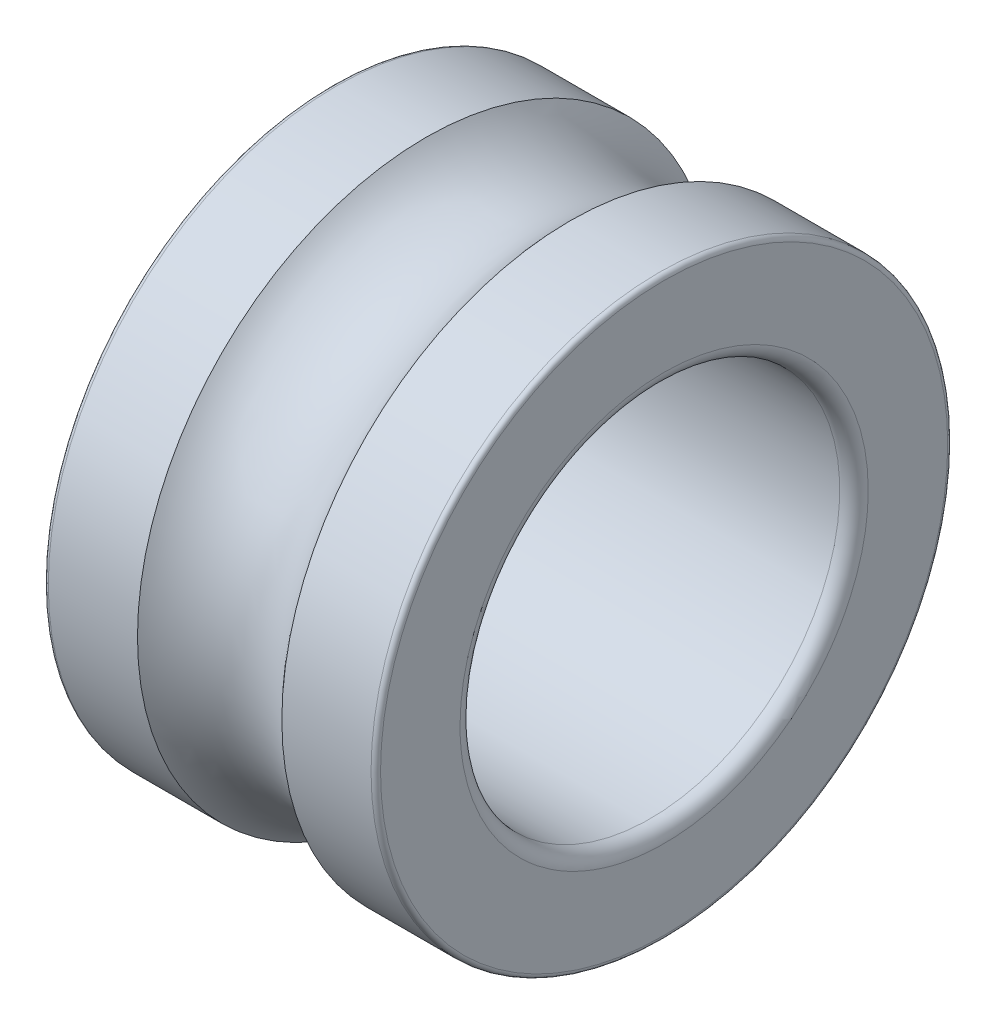
ISO-10303-21;
HEADER;
FILE_DESCRIPTION(('STEP AP214'),'2;1');
FILE_NAME('part.step','',(''),(''),'','','');
FILE_SCHEMA(('AUTOMOTIVE_DESIGN { 1 0 10303 214 1 1 1 1 }'));
ENDSEC;
DATA;
#1=APPLICATION_CONTEXT('core data for automotive mechanical design processes');
#2=APPLICATION_PROTOCOL_DEFINITION('international standard','automotive_design',2000,#1);
#3=PRODUCT_CONTEXT('',#1,'mechanical');
#4=PRODUCT('Part','Part','',(#3));
#5=PRODUCT_RELATED_PRODUCT_CATEGORY('part','',(#4));
#6=PRODUCT_DEFINITION_FORMATION('','',#4);
#7=PRODUCT_DEFINITION_CONTEXT('part definition',#1,'design');
#8=PRODUCT_DEFINITION('design','',#6,#7);
#9=PRODUCT_DEFINITION_SHAPE('','',#8);
#10=(LENGTH_UNIT() NAMED_UNIT(*) SI_UNIT(.MILLI.,.METRE.));
#11=(NAMED_UNIT(*) PLANE_ANGLE_UNIT() SI_UNIT($,.RADIAN.));
#12=(NAMED_UNIT(*) SI_UNIT($,.STERADIAN.) SOLID_ANGLE_UNIT());
#13=UNCERTAINTY_MEASURE_WITH_UNIT(LENGTH_MEASURE(1.E-05),#10,'distance_accuracy_value','');
#14=(GEOMETRIC_REPRESENTATION_CONTEXT(3) GLOBAL_UNCERTAINTY_ASSIGNED_CONTEXT((#13)) GLOBAL_UNIT_ASSIGNED_CONTEXT((#10,
#11,#12)) REPRESENTATION_CONTEXT('',''));
#15=CARTESIAN_POINT('',(0.,0.,0.));
#16=DIRECTION('',(0.,0.,1.));
#17=DIRECTION('',(1.,0.,0.));
#18=AXIS2_PLACEMENT_3D('',#15,#16,#17);
#19=CARTESIAN_POINT('',(3.5,0.,0.));
#20=DIRECTION('',(1.,0.,0.));
#21=DIRECTION('',(0.,1.,0.));
#22=AXIS2_PLACEMENT_3D('',#19,#20,#21);
#23=TOROIDAL_SURFACE('',#22,7.35,1.9845);
#24=CARTESIAN_POINT('',(1.979271473931,0.,0.));
#25=DIRECTION('',(-1.,0.,0.));
#26=DIRECTION('',(0.,0.,1.));
#27=AXIS2_PLACEMENT_3D('',#24,#25,#26);
#28=CIRCLE('',#27,6.075);
#29=CARTESIAN_POINT('',(1.979271473931,0.,6.075));
#30=VERTEX_POINT('',#29);
#31=EDGE_CURVE('E288',#30,#30,#28,.T.);
#32=ORIENTED_EDGE('',*,*,#31,.F.);
#33=EDGE_LOOP('',(#32));
#34=FACE_BOUND('',#33,.T.);
#35=CARTESIAN_POINT('',(5.02072852606901,0.,0.));
#36=DIRECTION('',(-1.,0.,0.));
#37=DIRECTION('',(0.,0.,1.));
#38=AXIS2_PLACEMENT_3D('',#35,#36,#37);
#39=CIRCLE('',#38,6.075);
#40=CARTESIAN_POINT('',(5.02072852606901,0.,6.075));
#41=VERTEX_POINT('',#40);
#42=EDGE_CURVE('E285',#41,#41,#39,.F.);
#43=ORIENTED_EDGE('',*,*,#42,.F.);
#44=EDGE_LOOP('',(#43));
#45=FACE_BOUND('',#44,.T.);
#46=ADVANCED_FACE('F16',(#34,#45),#23,.F.);
#47=CARTESIAN_POINT('',(100.,0.,0.));
#48=DIRECTION('',(-1.,0.,0.));
#49=DIRECTION('',(0.,0.,1.));
#50=AXIS2_PLACEMENT_3D('',#47,#48,#49);
#51=CYLINDRICAL_SURFACE('',#50,6.075);
#52=ORIENTED_EDGE('',*,*,#31,.T.);
#53=EDGE_LOOP('',(#52));
#54=FACE_BOUND('',#53,.T.);
#55=CARTESIAN_POINT('',(0.0999999999999228,0.,0.));
#56=DIRECTION('',(1.,0.,0.));
#57=DIRECTION('',(0.,1.,0.));
#58=AXIS2_PLACEMENT_3D('',#55,#56,#57);
#59=CIRCLE('',#58,6.075);
#60=CARTESIAN_POINT('',(0.0999999999999228,6.075,0.));
#61=VERTEX_POINT('',#60);
#62=EDGE_CURVE('E283',#61,#61,#59,.F.);
#63=ORIENTED_EDGE('',*,*,#62,.F.);
#64=EDGE_LOOP('',(#63));
#65=FACE_BOUND('',#64,.T.);
#66=ADVANCED_FACE('F93',(#54,#65),#51,.T.);
#67=CARTESIAN_POINT('',(100.,0.,0.));
#68=DIRECTION('',(-1.,0.,0.));
#69=DIRECTION('',(0.,0.,1.));
#70=AXIS2_PLACEMENT_3D('',#67,#68,#69);
#71=CYLINDRICAL_SURFACE('',#70,6.075);
#72=CARTESIAN_POINT('',(6.90000000000015,0.,0.));
#73=DIRECTION('',(1.,0.,0.));
#74=DIRECTION('',(0.,1.,0.));
#75=AXIS2_PLACEMENT_3D('',#72,#73,#74);
#76=CIRCLE('',#75,6.075);
#77=CARTESIAN_POINT('',(6.90000000000015,6.075,0.));
#78=VERTEX_POINT('',#77);
#79=EDGE_CURVE('E63',#78,#78,#76,.T.);
#80=ORIENTED_EDGE('',*,*,#79,.F.);
#81=EDGE_LOOP('',(#80));
#82=FACE_BOUND('',#81,.T.);
#83=ORIENTED_EDGE('',*,*,#42,.T.);
#84=EDGE_LOOP('',(#83));
#85=FACE_BOUND('',#84,.T.);
#86=ADVANCED_FACE('F86',(#82,#85),#71,.T.);
#87=CARTESIAN_POINT('',(0.0999999999999228,0.,0.));
#88=DIRECTION('',(1.,0.,0.));
#89=DIRECTION('',(0.,1.,0.));
#90=AXIS2_PLACEMENT_3D('',#87,#88,#89);
#91=TOROIDAL_SURFACE('',#90,5.975,0.1);
#92=ORIENTED_EDGE('',*,*,#62,.T.);
#93=EDGE_LOOP('',(#92));
#94=FACE_BOUND('',#93,.T.);
#95=CARTESIAN_POINT('',(0.,0.,0.));
#96=DIRECTION('',(1.,0.,0.));
#97=DIRECTION('',(0.,0.,1.));
#98=AXIS2_PLACEMENT_3D('',#95,#96,#97);
#99=CIRCLE('',#98,5.975);
#100=CARTESIAN_POINT('',(0.,0.,-5.975));
#101=VERTEX_POINT('',#100);
#102=CARTESIAN_POINT('',(0.,0.,5.975));
#103=VERTEX_POINT('',#102);
#104=EDGE_CURVE('E55',#101,#103,#99,.F.);
#105=ORIENTED_EDGE('',*,*,#104,.F.);
#106=CARTESIAN_POINT('',(0.,0.,0.));
#107=DIRECTION('',(1.,0.,0.));
#108=DIRECTION('',(0.,0.,-1.));
#109=AXIS2_PLACEMENT_3D('',#106,#107,#108);
#110=CIRCLE('',#109,5.975);
#111=EDGE_CURVE('E58',#103,#101,#110,.F.);
#112=ORIENTED_EDGE('',*,*,#111,.F.);
#113=EDGE_LOOP('',(#105,#112));
#114=FACE_BOUND('',#113,.T.);
#115=ADVANCED_FACE('F67',(#94,#114),#91,.T.);
#116=CARTESIAN_POINT('',(6.90000000000015,0.,0.));
#117=DIRECTION('',(1.,0.,0.));
#118=DIRECTION('',(0.,1.,0.));
#119=AXIS2_PLACEMENT_3D('',#116,#117,#118);
#120=TOROIDAL_SURFACE('',#119,5.975,0.1);
#121=CARTESIAN_POINT('',(7.00000000000015,0.,0.));
#122=DIRECTION('',(-1.,0.,0.));
#123=DIRECTION('',(0.,0.,1.));
#124=AXIS2_PLACEMENT_3D('',#121,#122,#123);
#125=CIRCLE('',#124,5.975);
#126=CARTESIAN_POINT('',(7.00000000000009,0.,-5.975));
#127=VERTEX_POINT('',#126);
#128=CARTESIAN_POINT('',(7.00000000000009,0.,5.975));
#129=VERTEX_POINT('',#128);
#130=EDGE_CURVE('E132',#127,#129,#125,.F.);
#131=ORIENTED_EDGE('',*,*,#130,.F.);
#132=CARTESIAN_POINT('',(7.00000000000015,0.,0.));
#133=DIRECTION('',(-1.,0.,0.));
#134=DIRECTION('',(0.,0.,-1.));
#135=AXIS2_PLACEMENT_3D('',#132,#133,#134);
#136=CIRCLE('',#135,5.975);
#137=EDGE_CURVE('E203',#129,#127,#136,.F.);
#138=ORIENTED_EDGE('',*,*,#137,.F.);
#139=EDGE_LOOP('',(#131,#138));
#140=FACE_BOUND('',#139,.T.);
#141=ORIENTED_EDGE('',*,*,#79,.T.);
#142=EDGE_LOOP('',(#141));
#143=FACE_BOUND('',#142,.T.);
#144=ADVANCED_FACE('F85',(#140,#143),#120,.T.);
#145=CARTESIAN_POINT('',(0.,5.975,0.));
#146=DIRECTION('',(-1.,0.,0.));
#147=DIRECTION('',(0.,0.,1.));
#148=AXIS2_PLACEMENT_3D('',#145,#146,#147);
#149=PLANE('',#148);
#150=ORIENTED_EDGE('',*,*,#111,.T.);
#151=ORIENTED_EDGE('',*,*,#104,.T.);
#152=EDGE_LOOP('',(#150,#151));
#153=FACE_BOUND('',#152,.T.);
#154=CARTESIAN_POINT('',(0.,0.,0.));
#155=DIRECTION('',(-1.,0.,0.));
#156=DIRECTION('',(0.,0.,1.));
#157=AXIS2_PLACEMENT_3D('',#154,#155,#156);
#158=CIRCLE('',#157,4.3);
#159=CARTESIAN_POINT('',(0.,0.,4.3));
#160=VERTEX_POINT('',#159);
#161=CARTESIAN_POINT('',(0.,0.,-4.3));
#162=VERTEX_POINT('',#161);
#163=EDGE_CURVE('E184',#160,#162,#158,.T.);
#164=ORIENTED_EDGE('',*,*,#163,.F.);
#165=CARTESIAN_POINT('',(0.,0.,-4.3));
#166=CARTESIAN_POINT('',(2.49671021800981E-09,-0.054046572801846,-4.30000073348312));
#167=CARTESIAN_POINT('',(3.48087412716175E-10,-0.108093051584243,-4.29899065394799));
#168=CARTESIAN_POINT('',(2.35188656253454E-09,-0.216107919266334,-4.29495330591717));
#169=CARTESIAN_POINT('',(6.5039938251434E-09,-0.270076311931317,-4.29192613817001));
#170=CARTESIAN_POINT('',(3.66976681778465E-08,-0.377860547298024,-4.28385919757216));
#171=CARTESIAN_POINT('',(6.27384343719903E-08,-0.431676395508992,-4.27881949836261));
#172=CARTESIAN_POINT('',(1.55972177695549E-07,-0.539080623330251,-4.26673154636945));
#173=CARTESIAN_POINT('',(2.2316419872104E-07,-0.592669008196273,-4.25968334025331));
#174=CARTESIAN_POINT('',(4.68071726509785E-07,-0.699546576635404,-4.24360101196496));
#175=CARTESIAN_POINT('',(6.45786141346539E-07,-0.752835763159248,-4.23456690941336));
#176=CARTESIAN_POINT('',(1.0418507888524E-06,-0.859045181134571,-4.21447557208069));
#177=CARTESIAN_POINT('',(1.26021056679227E-06,-0.911965322883642,-4.20341786208028));
#178=CARTESIAN_POINT('',(1.50514438922708E-06,-1.01732666182027,-4.1792528448078));
#179=CARTESIAN_POINT('',(1.53174993585892E-06,-1.06976793626417,-4.16614587455774));
#180=CARTESIAN_POINT('',(1.40938071885895E-06,-1.174092597275,-4.13791375438998));
#181=CARTESIAN_POINT('',(1.26044158298803E-06,-1.2259760948895,-4.12278901454216));
#182=CARTESIAN_POINT('',(8.57081734526432E-07,-1.32910856495396,-4.0905515192748));
#183=CARTESIAN_POINT('',(6.02686509931085E-07,-1.3803576876476,-4.07343924494725));
#184=CARTESIAN_POINT('',(1.77942178420886E-07,-1.48212973884337,-4.03722126557191));
#185=CARTESIAN_POINT('',(7.56954286386194E-09,-1.53265286679224,-4.01811612040051));
#186=CARTESIAN_POINT('',(-8.12431259894773E-09,-1.63663659883124,-3.97659587196171));
#187=CARTESIAN_POINT('',(1.7128668735591E-07,-1.69004118523969,-3.95404081235803));
#188=CARTESIAN_POINT('',(2.55090752332243E-07,-1.79597075624944,-3.90696536554014));
#189=CARTESIAN_POINT('',(1.59512400082297E-07,-1.8484958316974,-3.88244518284076));
#190=CARTESIAN_POINT('',(2.86630517072247E-08,-1.92657155764992,-3.84421592356576));
#191=CARTESIAN_POINT('',(-1.28678287933598E-08,-1.95247872722599,-3.83123103084005));
#192=CARTESIAN_POINT('',(2.352576789322E-08,-2.00399903154537,-3.80475148270328));
#193=CARTESIAN_POINT('',(1.01331966883277E-07,-2.02961243210967,-3.79125734494439));
#194=CARTESIAN_POINT('',(2.98647051560147E-07,-2.10599964303221,-3.74993940199472));
#195=CARTESIAN_POINT('',(3.82069424549149E-07,-2.15632435252802,-3.72127817810045));
#196=CARTESIAN_POINT('',(2.33392757075995E-07,-2.25564740842533,-3.66176235375574));
#197=CARTESIAN_POINT('',(1.3308325332146E-09,-2.30464591016013,-3.63090801172472));
#198=CARTESIAN_POINT('',(-1.36099111505517E-09,-2.40244930430766,-3.56653508193157));
#199=CARTESIAN_POINT('',(2.38541256310237E-07,-2.45122486987698,-3.53297208107998));
#200=CARTESIAN_POINT('',(3.50599624246333E-07,-2.54748637706888,-3.46405761800168));
#201=CARTESIAN_POINT('',(2.22802008220747E-07,-2.59497248017091,-3.428706381318));
#202=CARTESIAN_POINT('',(4.18529649493103E-08,-2.66517779619901,-3.37436010272899));
#203=CARTESIAN_POINT('',(-1.667331798547E-08,-2.68840942654281,-3.3560243561483));
#204=CARTESIAN_POINT('',(2.91664905174731E-08,-2.73446637693149,-3.31889317494392));
#205=CARTESIAN_POINT('',(1.33378497440828E-07,-2.75729206064616,-3.30009819171769));
#206=CARTESIAN_POINT('',(3.99145135959908E-07,-2.82512398737563,-3.24294925672565));
#207=CARTESIAN_POINT('',(5.13855692709291E-07,-2.86948903734758,-3.20382829948093));
#208=CARTESIAN_POINT('',(3.14151364569625E-07,-2.95637527857442,-3.12360806585847));
#209=CARTESIAN_POINT('',(-2.03498538097424E-10,-2.9988967268715,-3.082509066964));
#210=CARTESIAN_POINT('',(2.0363210482138E-10,-3.08227392383334,-2.99855655763944));
#211=CARTESIAN_POINT('',(3.15756360353574E-07,-3.12312751310941,-2.95570090820023));
#212=CARTESIAN_POINT('',(4.50812963996856E-07,-3.20318785652725,-2.86849330687443));
#213=CARTESIAN_POINT('',(2.703878612201E-07,-3.24239484563862,-2.82414157011923));
#214=CARTESIAN_POINT('',(7.09883368859781E-08,-3.30006384445633,-2.75663774432021));
#215=CARTESIAN_POINT('',(1.63944408036279E-08,-3.31909699519873,-2.73397326573285));
#216=CARTESIAN_POINT('',(1.84332790458536E-09,-3.34576929548992,-2.70123608887233));
#217=CARTESIAN_POINT('',(5.58135437689337E-09,-3.35368719545989,-2.69139083243446));
#218=CARTESIAN_POINT('',(2.11803381895731E-08,-3.39970488624447,-2.63366164906903));
#219=CARTESIAN_POINT('',(9.04540300892356E-09,-3.43684700243687,-2.58500851071631));
#220=CARTESIAN_POINT('',(-3.59069977410017E-09,-3.51654516085536,-2.47582279396198));
#221=CARTESIAN_POINT('',(-1.13185262829995E-09,-3.55861122179693,-2.41493186684719));
#222=CARTESIAN_POINT('',(8.86140752770533E-10,-3.63076861594309,-2.30451032039478));
#223=CARTESIAN_POINT('',(9.58723048321806E-10,-3.66147766562775,-2.25538168888329));
#224=CARTESIAN_POINT('',(1.92582828078602E-09,-3.72089036585843,-2.15592540561345));
#225=CARTESIAN_POINT('',(2.82034699147558E-09,-3.74959402671491,-2.10559776002147));
#226=CARTESIAN_POINT('',(3.67005066836595E-09,-3.80494863134142,-2.00382644304023));
#227=CARTESIAN_POINT('',(3.62523724451529E-09,-3.83159957862956,-1.9523827735639));
#228=CARTESIAN_POINT('',(2.86516049213339E-09,-3.88280610801995,-1.84846278432108));
#229=CARTESIAN_POINT('',(2.14989601449691E-09,-3.90736168653079,-1.79598646278485));
#230=CARTESIAN_POINT('',(7.34654162502496E-10,-3.95433600806416,-1.69008545171056));
#231=CARTESIAN_POINT('',(3.46768667664994E-11,-3.97675474009888,-1.63666075729758));
#232=CARTESIAN_POINT('',(-3.24769553495569E-11,-4.0179986169609,-1.53255332267863));
#233=CARTESIAN_POINT('',(5.14389107237958E-10,-4.03696379965678,-1.48192599041615));
#234=CARTESIAN_POINT('',(9.54549908405753E-09,-4.07298563372572,-1.37999818932739));
#235=CARTESIAN_POINT('',(1.80295319219935E-08,-4.09004233583827,-1.32869773843739));
#236=CARTESIAN_POINT('',(5.80920562090601E-08,-4.12222274875682,-1.22549503332114));
#237=CARTESIAN_POINT('',(8.96701564554287E-08,-4.13734649230115,-1.17359278930364));
#238=CARTESIAN_POINT('',(1.8785405654975E-07,-4.16563760809087,-1.06925835461273));
#239=CARTESIAN_POINT('',(2.54459601172312E-07,-4.17880499459024,-1.01682616780344));
#240=CARTESIAN_POINT('',(4.73169668582413E-07,-4.20317591649102,-0.911507058654501));
#241=CARTESIAN_POINT('',(6.25274393614012E-07,-4.21437944724696,-0.858620135239488));
#242=CARTESIAN_POINT('',(9.48511712861195E-07,-4.23476446331087,-0.75246832558631));
#243=CARTESIAN_POINT('',(1.11964051005336E-06,-4.24394635103298,-0.699203516750229));
#244=CARTESIAN_POINT('',(1.30028680363113E-06,-4.26023867461276,-0.592365381904515));
#245=CARTESIAN_POINT('',(1.30982728190566E-06,-4.26734940489928,-0.538792100851542));
#246=CARTESIAN_POINT('',(1.18883413384728E-06,-4.27949055884739,-0.431420714503159));
#247=CARTESIAN_POINT('',(1.05832523407056E-06,-4.28452134951757,-0.377622650564722));
#248=CARTESIAN_POINT('',(7.10101902679302E-07,-4.29252904904527,-0.269883785773033));
#249=CARTESIAN_POINT('',(4.92405862159521E-07,-4.29550639069323,-0.21594301740382));
#250=CARTESIAN_POINT('',(1.52291325852447E-07,-4.29927054959419,-0.107999581529397));
#251=CARTESIAN_POINT('',(2.98494877460852E-08,-4.30005790363189,-0.0539969324387693));
#252=CARTESIAN_POINT('',(-1.51167983332897E-08,-4.29997067580477,0.0273457214557082));
#253=CARTESIAN_POINT('',(-6.4861712400385E-09,-4.29972456636682,0.0546899767481284));
#254=CARTESIAN_POINT('',(1.51501621976376E-08,-4.29806056113197,0.145306606330561));
#255=CARTESIAN_POINT('',(1.89972501234406E-08,-4.29552770143827,0.208564531285454));
#256=CARTESIAN_POINT('',(9.95550454320622E-08,-4.28880794521745,0.316773012944989));
#257=CARTESIAN_POINT('',(1.55039334445988E-07,-4.28530429028855,0.361767848895122));
#258=CARTESIAN_POINT('',(2.71965709995477E-07,-4.27820157355766,0.437536161977546));
#259=CARTESIAN_POINT('',(3.26084758121884E-07,-4.27497688974408,0.468345103747978));
#260=CARTESIAN_POINT('',(4.81445279822012E-07,-4.26499820619289,0.554584167660605));
#261=CARTESIAN_POINT('',(5.85645569556012E-07,-4.25748880957285,0.609929183821199));
#262=CARTESIAN_POINT('',(7.2578453003893E-07,-4.24154406061026,0.712222530246199));
#263=CARTESIAN_POINT('',(7.69466653438446E-07,-4.23340383539211,0.759217372603164));
#264=CARTESIAN_POINT('',(8.00023756271925E-07,-4.21435245768529,0.859133696076649));
#265=CARTESIAN_POINT('',(7.78575561671954E-07,-4.20321680745278,0.912012595966069));
#266=CARTESIAN_POINT('',(7.01692481194374E-07,-4.17894640193969,1.01730480495944));
#267=CARTESIAN_POINT('',(6.46260124843912E-07,-4.16581179550118,1.0697181484214));
#268=CARTESIAN_POINT('',(5.0673363222123E-07,-4.13755807392831,1.17400239895525));
#269=CARTESIAN_POINT('',(4.22642018271043E-07,-4.12243913350861,1.22587335334927));
#270=CARTESIAN_POINT('',(2.55298167537419E-07,-4.09024287583351,1.3289982090508));
#271=CARTESIAN_POINT('',(1.72045846379708E-07,-4.07316575761366,1.38025217248716));
#272=CARTESIAN_POINT('',(4.45975579850565E-08,-4.03706931961047,1.48206456422819));
#273=CARTESIAN_POINT('',(3.97095687904752E-10,-4.0180502236395,1.53262307192355));
#274=CARTESIAN_POINT('',(-4.26015843379237E-10,-3.97668180982946,1.63663032965521));
#275=CARTESIAN_POINT('',(4.95340782899777E-08,-3.95419101379811,1.69002282575281));
#276=CARTESIAN_POINT('',(1.48954193274882E-07,-3.90711521368744,1.79587308448857));
#277=CARTESIAN_POINT('',(1.98414235687197E-07,-3.88253030033483,1.84833088750296));
#278=CARTESIAN_POINT('',(2.4818898123487E-07,-3.83129818856904,1.95222946680694));
#279=CARTESIAN_POINT('',(2.48504393763997E-07,-3.8046510199297,2.00367025776619));
#280=CARTESIAN_POINT('',(1.98098818605082E-07,-3.74932573044694,2.10544694879042));
#281=CARTESIAN_POINT('',(1.47377094205142E-07,-3.72064758029224,2.15578283289556));
#282=CARTESIAN_POINT('',(5.11112456550879E-08,-3.66135087705918,2.25530599900624));
#283=CARTESIAN_POINT('',(5.56734581309842E-09,-3.63073224000657,2.30449323117782));
#284=CARTESIAN_POINT('',(-1.74361553253288E-09,-3.58916832942516,2.36819349678692));
#285=CARTESIAN_POINT('',(4.33586311153659E-10,-3.57915465688263,2.38331850674717));
#286=CARTESIAN_POINT('',(4.83159872527888E-09,-3.54749860475765,2.43046493234713));
#287=CARTESIAN_POINT('',(4.31829134336487E-09,-3.52550975226286,2.46225436593073));
#288=CARTESIAN_POINT('',(3.85816431818994E-09,-3.46878766889192,2.54193839148287));
#289=CARTESIAN_POINT('',(4.35645532754861E-09,-3.43348309975855,2.58942822036535));
#290=CARTESIAN_POINT('',(3.99786664872031E-09,-3.37436290390168,2.66561105436789));
#291=CARTESIAN_POINT('',(3.57414799160279E-09,-3.35112902859722,2.69475812462217));
#292=CARTESIAN_POINT('',(2.70377602360775E-09,-3.30066235810383,2.75640604884744));
#293=CARTESIAN_POINT('',(2.26198602392029E-09,-3.27331912750893,2.7888166926069));
#294=CARTESIAN_POINT('',(1.36358423842418E-09,-3.21432159702317,2.85668404483566));
#295=CARTESIAN_POINT('',(9.11640179067777E-10,-3.18254581267751,2.89203517191258));
#296=CARTESIAN_POINT('',(2.16038078231832E-10,-3.11434868378958,2.96541980144142));
#297=CARTESIAN_POINT('',(1.07620204615309E-13,-3.07779597075926,3.00333129242513));
#298=CARTESIAN_POINT('',(-2.48447094288664E-13,-2.99915840396443,3.08194996900252));
#299=CARTESIAN_POINT('',(2.66278335613547E-10,-2.95691199957755,3.12249571598503));
#300=CARTESIAN_POINT('',(1.04133446670758E-09,-2.87080039556793,3.20182929760167));
#301=CARTESIAN_POINT('',(1.54986282360226E-09,-2.82693520257812,3.24061713943731));
#302=CARTESIAN_POINT('',(2.58310624735405E-09,-2.73765854335915,3.31637036505978));
#303=CARTESIAN_POINT('',(3.1078212644683E-09,-2.69224708188174,3.35333575444623));
#304=CARTESIAN_POINT('',(4.0119538238763E-09,-2.59995364163631,3.42538253601005));
#305=CARTESIAN_POINT('',(4.3913716638126E-09,-2.55307166588088,3.46046393204666));
#306=CARTESIAN_POINT('',(4.90796465452174E-09,-2.4579152222908,3.5286843313083));
#307=CARTESIAN_POINT('',(5.04514005341417E-09,-2.40964075588249,3.5618233365228));
#308=CARTESIAN_POINT('',(5.0452962456009E-09,-2.31177971031584,3.62610377188376));
#309=CARTESIAN_POINT('',(4.90827703889519E-09,-2.2621931311575,3.65724520203021));
#310=CARTESIAN_POINT('',(4.39105927911918E-09,-2.16179044107248,3.71747868386719));
#311=CARTESIAN_POINT('',(4.01086047696939E-09,-2.11097432888647,3.74657073345857));
#312=CARTESIAN_POINT('',(3.10891461361496E-09,-2.00819707962518,3.80265684733868));
#313=CARTESIAN_POINT('',(2.58716726244691E-09,-1.9562359402045,3.8296509073295));
#314=CARTESIAN_POINT('',(1.54580179603079E-09,-1.85125550226925,3.88149671199112));
#315=CARTESIAN_POINT('',(1.02618368733032E-09,-1.79823620050368,3.9063484500788));
#316=CARTESIAN_POINT('',(2.81429177063967E-10,-1.69122636345067,3.95386590149735));
#317=CARTESIAN_POINT('',(5.62939820063676E-11,-1.63723582418494,3.97653160587161));
#318=CARTESIAN_POINT('',(-5.20866068593979E-11,-1.53256003480818,4.01799162998321));
#319=CARTESIAN_POINT('',(3.97317497011633E-11,-1.48193950152137,4.03694959318503));
#320=CARTESIAN_POINT('',(6.04049384981207E-09,-1.3800264294164,4.07295917482225));
#321=CARTESIAN_POINT('',(1.19492569824382E-08,-1.32873391151155,4.09001085242781));
#322=CARTESIAN_POINT('',(4.45613137470448E-08,-1.22554782394897,4.12218275939642));
#323=CARTESIAN_POINT('',(7.12641798462631E-08,-1.17365426667039,4.13730302846235));
#324=CARTESIAN_POINT('',(1.58396551747898E-07,-1.06933784992578,4.1655890047768));
#325=CARTESIAN_POINT('',(2.18825717850586E-07,-1.01691499579617,4.17875473171027));
#326=CARTESIAN_POINT('',(4.25189098508513E-07,-0.911615049208006,4.20312412479821));
#327=CARTESIAN_POINT('',(5.71123348510446E-07,-0.858737956561146,4.2143277901393));
#328=CARTESIAN_POINT('',(8.8706575078935E-07,-0.752588752578236,4.23471832822449));
#329=CARTESIAN_POINT('',(1.057076909808E-06,-0.699316592694484,4.24390494871259));
#330=CARTESIAN_POINT('',(1.24131551164177E-06,-0.592463125570522,4.26020421616493));
#331=CARTESIAN_POINT('',(1.25556391136402E-06,-0.538881860889029,4.26731714200648));
#332=CARTESIAN_POINT('',(1.14553685961624E-06,-0.431494033437071,4.27946994662095));
#333=CARTESIAN_POINT('',(1.02128478010039E-06,-0.377687510205249,4.28451017496508));
#334=CARTESIAN_POINT('',(6.89707948896087E-07,-0.269930822841744,4.29250785831248));
#335=CARTESIAN_POINT('',(4.8240005800122E-07,-0.215980690070391,4.29546573570879));
#336=CARTESIAN_POINT('',(1.44145825888814E-07,-0.108019264741061,4.29929655509646));
#337=CARTESIAN_POINT('',(1.3181392231438E-08,-0.0540079897155524,4.30016999122614));
#338=CARTESIAN_POINT('',(0.,0.,4.3));
#339=B_SPLINE_CURVE_WITH_KNOTS('',3,(#165,#166,#167,#168,#169,#170,#171,#172,#173,#174,#175,
#176,#177,#178,#179,#180,#181,#182,#183,#184,#185,#186,#187,#188,#189,#190,#191,#192,#193,#194,
#195,#196,#197,#198,#199,#200,#201,#202,#203,#204,#205,#206,#207,#208,#209,#210,#211,#212,#213,
#214,#215,#216,#217,#218,#219,#220,#221,#222,#223,#224,#225,#226,#227,#228,#229,#230,#231,#232,
#233,#234,#235,#236,#237,#238,#239,#240,#241,#242,#243,#244,#245,#246,#247,#248,#249,#250,#251,
#252,#253,#254,#255,#256,#257,#258,#259,#260,#261,#262,#263,#264,#265,#266,#267,#268,#269,#270,
#271,#272,#273,#274,#275,#276,#277,#278,#279,#280,#281,#282,#283,#284,#285,#286,#287,#288,#289,
#290,#291,#292,#293,#294,#295,#296,#297,#298,#299,#300,#301,#302,#303,#304,#305,#306,#307,#308,
#309,#310,#311,#312,#313,#314,#315,#316,#317,#318,#319,#320,#321,#322,#323,#324,#325,#326,#327,
#328,#329,#330,#331,#332,#333,#334,#335,#336,#337,#338),.UNSPECIFIED.,.F.,.F.,(4,2,2,2,2,2,2,2,
2,2,2,2,2,2,2,2,2,2,2,2,2,2,2,2,2,2,2,2,2,2,2,2,2,2,2,2,2,2,2,2,2,2,2,2,2,2,2,2,2,2,2,2,2,2,2,2,
2,2,2,2,2,2,2,2,2,2,2,2,2,2,2,2,2,2,2,2,2,2,2,2,2,2,2,2,2,2,4),(0.,0.162130113914324,
0.32425213044127,0.486368215256496,0.648480533626549,0.81059125040331,0.972740085856152,
1.13486228225527,1.29695158072608,1.45900172617301,1.62100646730706,1.79488178567824,
1.96873903188975,2.05567157085805,2.14251800430378,2.31619790913304,2.48985738273459,
2.66743613436074,2.84499254426294,2.93377464221133,3.02247273009467,3.19985404646779,
3.37721055158609,3.55478983557015,3.7323436923119,3.82112445440585,3.8590263680324,
4.04259768525657,4.26451882787214,4.438284824415,4.61204992749483,4.78581473275363,
4.95957983583346,5.13334583237632,5.29549727940909,5.45764441440523,5.61978880276792,
5.78193200969154,5.94407560015846,6.1061868862175,6.26827511581499,6.4303347324728,
6.59236018256322,6.7543459153285,6.83638051484986,7.02623486266725,7.1616068829139,
7.25453263861387,7.42204049039357,7.56509932447484,7.72717480304711,7.88923821939581,
8.05128737610756,8.21332007619331,8.37533412309098,8.54909595223578,8.72285025705011,
8.89660205375251,9.07035635856684,9.24411818771164,9.29853548432151,9.4144814358322,
9.59195014213987,9.70376191952513,9.83095485745372,9.97352835199883,10.1314817054582,
10.3070979255034,10.482713426047,10.6583283869645,10.8339429881313,11.0095574094227,
11.1851718307141,11.3607864318809,11.5364013927984,11.7120168933421,11.8876331133872,
12.0497579992373,12.2118778514138,12.3739943704472,12.536109256632,12.6982242100226,
12.8603594263264,13.0224728280803,13.1845588773405,13.3466120388868,13.508626780241),.UNSPECIFIED.);
#340=EDGE_CURVE('E68',#162,#160,#339,.T.);
#341=ORIENTED_EDGE('',*,*,#340,.F.);
#342=EDGE_LOOP('',(#164,#341));
#343=FACE_BOUND('',#342,.T.);
#344=ADVANCED_FACE('F60',(#153,#343),#149,.T.);
#345=CARTESIAN_POINT('',(7.,4.3,0.));
#346=DIRECTION('',(1.,0.,0.));
#347=DIRECTION('',(0.,0.,-1.));
#348=AXIS2_PLACEMENT_3D('',#345,#346,#347);
#349=PLANE('',#348);
#350=CARTESIAN_POINT('',(7.00000000000012,0.,0.));
#351=DIRECTION('',(1.,0.,0.));
#352=DIRECTION('',(0.,0.,-1.));
#353=AXIS2_PLACEMENT_3D('',#350,#351,#352);
#354=CIRCLE('',#353,4.3);
#355=CARTESIAN_POINT('',(7.00000000000007,0.,-4.3));
#356=VERTEX_POINT('',#355);
#357=CARTESIAN_POINT('',(7.00000000000007,0.,4.3));
#358=VERTEX_POINT('',#357);
#359=EDGE_CURVE('E171',#356,#358,#354,.T.);
#360=ORIENTED_EDGE('',*,*,#359,.F.);
#361=CARTESIAN_POINT('',(7.00000000000012,0.,4.3));
#362=CARTESIAN_POINT('',(6.99999999750335,-0.0540465728019896,4.30000073348312));
#363=CARTESIAN_POINT('',(6.99999999965197,-0.108093051584532,4.29899065394799));
#364=CARTESIAN_POINT('',(6.99999999764817,-0.216107919266909,4.29495330591717));
#365=CARTESIAN_POINT('',(6.99999999349607,-0.270076311932032,4.29192613817001));
#366=CARTESIAN_POINT('',(6.99999996330239,-0.377860547299018,4.28385919757216));
#367=CARTESIAN_POINT('',(6.99999993726162,-0.431676395510124,4.27881949836261));
#368=CARTESIAN_POINT('',(6.99999984402788,-0.539080623331656,4.26673154636945));
#369=CARTESIAN_POINT('',(6.99999977683586,-0.592669008197814,4.2596833402533));
#370=CARTESIAN_POINT('',(6.99999953192833,-0.699546576637216,4.24360101196496));
#371=CARTESIAN_POINT('',(6.99999935421392,-0.752835763161197,4.23456690941336));
#372=CARTESIAN_POINT('',(6.99999895814927,-0.859045181136551,4.21447557208073));
#373=CARTESIAN_POINT('',(6.99999873978949,-0.911965322885519,4.20341786208036));
#374=CARTESIAN_POINT('',(6.99999849485567,-1.01732666182192,4.17925284480793));
#375=CARTESIAN_POINT('',(6.99999846825012,-1.0697679362657,4.16614587455788));
#376=CARTESIAN_POINT('',(6.99999859061934,-1.17409259727628,4.13791375439014));
#377=CARTESIAN_POINT('',(6.99999873955847,-1.22597609489064,4.12278901454231));
#378=CARTESIAN_POINT('',(6.99999914291832,-1.32910856495482,4.09055151927493));
#379=CARTESIAN_POINT('',(6.99999939731355,-1.3803576876483,4.07343924494737));
#380=CARTESIAN_POINT('',(6.99999982205788,-1.48212973884373,4.03722126557198));
#381=CARTESIAN_POINT('',(6.99999999243052,-1.53265286679242,4.01811612040054));
#382=CARTESIAN_POINT('',(7.00000000812437,-1.63663659883146,3.97659587196152));
#383=CARTESIAN_POINT('',(6.99999982871337,-1.69004118524011,3.95404081235765));
#384=CARTESIAN_POINT('',(6.99999974490931,-1.79597075625033,3.90696536553943));
#385=CARTESIAN_POINT('',(6.99999984048766,-1.84849583169854,3.8824451828399));
#386=CARTESIAN_POINT('',(6.99999997133701,-1.92657155765146,3.84421592356472));
#387=CARTESIAN_POINT('',(7.00000001286789,-1.95247872722766,3.83123103083895));
#388=CARTESIAN_POINT('',(6.99999997647429,-2.00399903154704,3.8047514827022));
#389=CARTESIAN_POINT('',(6.99999989866809,-2.02961243211122,3.7912573449434));
#390=CARTESIAN_POINT('',(6.99999970135301,-2.10599964303339,3.74993940199398));
#391=CARTESIAN_POINT('',(6.99999961793063,-2.15632435252896,3.72127817809987));
#392=CARTESIAN_POINT('',(6.9999997666073,-2.25564740842579,3.66176235375545));
#393=CARTESIAN_POINT('',(6.99999999866923,-2.30464591016036,3.63090801172457));
#394=CARTESIAN_POINT('',(7.00000000136105,-2.40244930430781,3.56653508193146));
#395=CARTESIAN_POINT('',(6.9999997614588,-2.45122486987729,3.53297208107976));
#396=CARTESIAN_POINT('',(6.99999964940044,-2.54748637706948,3.46405761800125));
#397=CARTESIAN_POINT('',(6.99999977719805,-2.59497248017166,3.42870638131748));
#398=CARTESIAN_POINT('',(6.99999995814709,-2.66517779619998,3.37436010272833));
#399=CARTESIAN_POINT('',(7.00000001667338,-2.68840942654385,3.35602435614759));
#400=CARTESIAN_POINT('',(6.99999997083357,-2.73446637693255,3.31889317494322));
#401=CARTESIAN_POINT('',(6.99999986662156,-2.75729206064716,3.30009819171705));
#402=CARTESIAN_POINT('',(6.99999960085492,-2.82512398737644,3.24294925672518));
#403=CARTESIAN_POINT('',(6.99999948614437,-2.86948903734827,3.20382829948058));
#404=CARTESIAN_POINT('',(6.99999968584869,-2.95637527857476,3.12360806585828));
#405=CARTESIAN_POINT('',(7.00000000020356,-2.99889672687161,3.08250906696385));
#406=CARTESIAN_POINT('',(6.99999999979643,-3.08227392383347,2.99855655763934));
#407=CARTESIAN_POINT('',(6.9999996842437,-3.12312751310978,2.95570090820012));
#408=CARTESIAN_POINT('',(6.99999954918709,-3.2031878565273,2.86849330687365));
#409=CARTESIAN_POINT('',(6.9999997296122,-3.24239484563809,2.82414157011777));
#410=CARTESIAN_POINT('',(6.99999992901172,-3.30006384445734,2.75663774431967));
#411=CARTESIAN_POINT('',(6.99999998360562,-3.31909699520065,2.73397326573294));
#412=CARTESIAN_POINT('',(6.99999999815673,-3.34576929538755,2.70123608899664));
#413=CARTESIAN_POINT('',(6.99999999441871,-3.35368719525569,2.6913908326851));
#414=CARTESIAN_POINT('',(6.99999997881972,-3.39970488604383,2.63366164932271));
#415=CARTESIAN_POINT('',(6.99999999095466,-3.4368470023404,2.58500851084543));
#416=CARTESIAN_POINT('',(7.00000000359076,-3.51654516085738,2.47582279396272));
#417=CARTESIAN_POINT('',(7.00000000113191,-3.55861122179818,2.41493186684766));
#418=CARTESIAN_POINT('',(6.99999999911392,-3.63076861594223,2.30451032039423));
#419=CARTESIAN_POINT('',(6.99999999904134,-3.66147766562573,2.25538168888205));
#420=CARTESIAN_POINT('',(6.99999999807423,-3.72089036585479,2.15592540561135));
#421=CARTESIAN_POINT('',(6.99999999717971,-3.74959402671082,2.10559776001919));
#422=CARTESIAN_POINT('',(6.99999999633001,-3.80494863133683,2.00382644303782));
#423=CARTESIAN_POINT('',(6.99999999637482,-3.83159957862494,1.95238277356155));
#424=CARTESIAN_POINT('',(6.9999999971349,-3.88280610801573,1.84846278431906));
#425=CARTESIAN_POINT('',(6.99999999785016,-3.90736168652702,1.79598646278312));
#426=CARTESIAN_POINT('',(6.9999999992654,-3.95433600806194,1.6900854517096));
#427=CARTESIAN_POINT('',(6.99999999996538,-3.97675474009776,1.63666075729712));
#428=CARTESIAN_POINT('',(7.00000000003254,-4.01799861696189,1.5325533226792));
#429=CARTESIAN_POINT('',(6.99999999948567,-4.03696379965878,1.48192599041726));
#430=CARTESIAN_POINT('',(6.99999999045456,-4.07298563372919,1.37999818932923));
#431=CARTESIAN_POINT('',(6.99999998197052,-4.09004233584219,1.32869773843941));
#432=CARTESIAN_POINT('',(6.999999941908,-4.12222274876124,1.22549503332329));
#433=CARTESIAN_POINT('',(6.9999999103299,-4.13734649230559,1.17359278930574));
#434=CARTESIAN_POINT('',(6.999999812146,-4.16563760809491,1.06925835461451));
#435=CARTESIAN_POINT('',(6.99999974554045,-4.17880499459385,1.01682616780496));
#436=CARTESIAN_POINT('',(6.99999952683039,-4.20317591649316,0.91150705865534));
#437=CARTESIAN_POINT('',(6.99999937472566,-4.21437944724803,0.858620135239896));
#438=CARTESIAN_POINT('',(6.99999905148835,-4.23476446330972,0.752468325586296));
#439=CARTESIAN_POINT('',(6.99999888035955,-4.24394635103069,0.699203516750226));
#440=CARTESIAN_POINT('',(6.99999869971327,-4.26023867460884,0.592365381904604));
#441=CARTESIAN_POINT('',(6.99999869017279,-4.26734940489486,0.538792100851713));
#442=CARTESIAN_POINT('',(6.99999881116594,-4.27949055884249,0.431420714503475));
#443=CARTESIAN_POINT('',(6.99999894167484,-4.28452134951267,0.377622650565103));
#444=CARTESIAN_POINT('',(6.99999928989817,-4.29252904904088,0.269883785773476));
#445=CARTESIAN_POINT('',(6.9999995075942,-4.29550639068934,0.215943017404261));
#446=CARTESIAN_POINT('',(6.99999984770873,-4.2992705495919,0.107999581529697));
#447=CARTESIAN_POINT('',(6.99999997015057,-4.30005790363068,0.0539969324389313));
#448=CARTESIAN_POINT('',(7.00000001511686,-4.29997067580548,-0.0273457213583858));
#449=CARTESIAN_POINT('',(7.00000000648623,-4.29972456636982,-0.0546899765535083));
#450=CARTESIAN_POINT('',(6.9999999848499,-4.29806056114315,-0.145306606071223));
#451=CARTESIAN_POINT('',(6.99999998100281,-4.29552770145115,-0.208564531058731));
#452=CARTESIAN_POINT('',(6.99999990044501,-4.28880794522826,-0.316773012815705));
#453=CARTESIAN_POINT('',(6.99999984496072,-4.28530429029497,-0.361767848830605));
#454=CARTESIAN_POINT('',(6.99999972803435,-4.27820157353091,-0.437536162260334));
#455=CARTESIAN_POINT('',(6.9999996739153,-4.27497688968445,-0.468345104312916));
#456=CARTESIAN_POINT('',(6.99999951855478,-4.26499820606677,-0.554584168646725));
#457=CARTESIAN_POINT('',(6.99999941435449,-4.25748880941401,-0.609929184946301));
#458=CARTESIAN_POINT('',(6.99999927421553,-4.24154406046475,-0.712222531085909));
#459=CARTESIAN_POINT('',(6.9999992305334,-4.23340383531241,-0.759217373021723));
#460=CARTESIAN_POINT('',(6.9999991999763,-4.21435245768521,-0.859133696076626));
#461=CARTESIAN_POINT('',(6.9999992214245,-4.2032168074523,-0.912012595965933));
#462=CARTESIAN_POINT('',(6.99999929830758,-4.17894640193874,-1.01730480495912));
#463=CARTESIAN_POINT('',(6.99999935373994,-4.16581179550016,-1.06971814842101));
#464=CARTESIAN_POINT('',(6.99999949326643,-4.13755807392722,-1.17400239895478));
#465=CARTESIAN_POINT('',(6.99999957735804,-4.12243913350752,-1.22587335334877));
#466=CARTESIAN_POINT('',(6.99999974470189,-4.09024287583254,-1.32899820905033));
#467=CARTESIAN_POINT('',(6.99999982795421,-4.07316575761279,-1.38025217248672));
#468=CARTESIAN_POINT('',(6.9999999554025,-4.03706931960997,-1.48206456422792));
#469=CARTESIAN_POINT('',(6.99999999960296,-4.01805022363925,-1.53262307192341));
#470=CARTESIAN_POINT('',(7.00000000042607,-3.97668180982974,-1.63663032965533));
#471=CARTESIAN_POINT('',(6.99999995046598,-3.95419101379868,-1.69002282575305));
#472=CARTESIAN_POINT('',(6.99999985104587,-3.90711521368835,-1.79587308448899));
#473=CARTESIAN_POINT('',(6.99999980158582,-3.88253030033581,-1.84833088750342));
#474=CARTESIAN_POINT('',(6.99999975181108,-3.83129818857025,-1.95222946680756));
#475=CARTESIAN_POINT('',(6.99999975149567,-3.80465101993106,-2.00367025776694));
#476=CARTESIAN_POINT('',(6.99999980190124,-3.74932573044772,-2.10544694879083));
#477=CARTESIAN_POINT('',(6.99999985262296,-3.72064758029227,-2.15578283289549));
#478=CARTESIAN_POINT('',(6.99999994888881,-3.66135087706055,-2.25530599900713));
#479=CARTESIAN_POINT('',(6.99999999443271,-3.63073224001003,-2.30449323118017));
#480=CARTESIAN_POINT('',(7.00000000174367,-3.58916833002894,-2.36819349585918));
#481=CARTESIAN_POINT('',(6.99999999956647,-3.57915465810202,-2.38331850489944));
#482=CARTESIAN_POINT('',(6.99999999516846,-3.54749860693634,-2.43046492914357));
#483=CARTESIAN_POINT('',(6.99999999568177,-3.52550975478694,-2.46225436229284));
#484=CARTESIAN_POINT('',(6.9999999961419,-3.46878767182897,-2.54193838745928));
#485=CARTESIAN_POINT('',(6.9999999956436,-3.43348310275062,-2.58942821638254));
#486=CARTESIAN_POINT('',(6.99999999600219,-3.37436290685536,-2.66561105061778));
#487=CARTESIAN_POINT('',(6.99999999642591,-3.35112903145353,-2.69475812105982));
#488=CARTESIAN_POINT('',(6.99999999729628,-3.30066236067296,-2.75640604576503));
#489=CARTESIAN_POINT('',(6.99999999773807,-3.27331912988442,-2.78881668981374));
#490=CARTESIAN_POINT('',(6.99999999863648,-3.21432159890767,-2.8566840427155));
#491=CARTESIAN_POINT('',(6.99999999908842,-3.18254581426021,-2.89203517017247));
#492=CARTESIAN_POINT('',(6.99999999978402,-3.11434868465226,-2.96541980054315));
#493=CARTESIAN_POINT('',(6.99999999999995,-3.07779597119869,-3.0033312919841));
#494=CARTESIAN_POINT('',(7.00000000000031,-2.99915840396533,-3.08194996900352));
#495=CARTESIAN_POINT('',(6.99999999973378,-2.95691199957936,-3.12249571598697));
#496=CARTESIAN_POINT('',(6.99999999895873,-2.87080039557123,-3.20182929760534));
#497=CARTESIAN_POINT('',(6.9999999984502,-2.826935202582,-3.24061713944176));
#498=CARTESIAN_POINT('',(6.99999999741695,-2.73765854336397,-3.31637036506563));
#499=CARTESIAN_POINT('',(6.99999999689224,-2.69224708188692,-3.35333575445269));
#500=CARTESIAN_POINT('',(6.99999999598811,-2.599953641642,-3.42538253601754));
#501=CARTESIAN_POINT('',(6.99999999560869,-2.55307166588671,-3.46046393205457));
#502=CARTESIAN_POINT('',(6.9999999950921,-2.45791522229674,-3.52868433131682));
#503=CARTESIAN_POINT('',(6.99999999495492,-2.40964075588839,-3.56182333653152));
#504=CARTESIAN_POINT('',(6.99999999495476,-2.3117797103215,-3.62610377189263));
#505=CARTESIAN_POINT('',(6.99999999509178,-2.26219313116297,-3.65724520203905));
#506=CARTESIAN_POINT('',(6.999999995609,-2.16179044107742,-3.71747868387568));
#507=CARTESIAN_POINT('',(6.9999999959892,-2.11097432889109,-3.74657073346677));
#508=CARTESIAN_POINT('',(6.99999999689115,-2.00819707962905,-3.80265684734599));
#509=CARTESIAN_POINT('',(6.99999999741289,-1.95623594020795,-3.82965090733624));
#510=CARTESIAN_POINT('',(6.99999999845426,-1.8512555022718,-3.88149671199645));
#511=CARTESIAN_POINT('',(6.99999999897388,-1.79823620050575,-3.90634845008329));
#512=CARTESIAN_POINT('',(6.99999999971863,-1.69122636345171,-3.95386590149977));
#513=CARTESIAN_POINT('',(6.99999999994376,-1.63723582418544,-3.97653160587279));
#514=CARTESIAN_POINT('',(7.00000000005214,-1.53256003480771,-4.01799162998213));
#515=CARTESIAN_POINT('',(6.99999999996033,-1.48193950152047,-4.03694959318291));
#516=CARTESIAN_POINT('',(6.99999999395957,-1.38002642941499,-4.07295917481861));
#517=CARTESIAN_POINT('',(6.9999999880508,-1.32873391151006,-4.09001085242368));
#518=CARTESIAN_POINT('',(6.99999995543875,-1.22554782394758,-4.12218275939178));
#519=CARTESIAN_POINT('',(6.99999992873588,-1.17365426666918,-4.13730302845768));
#520=CARTESIAN_POINT('',(6.99999984160351,-1.06933784992512,-4.16558900477255));
#521=CARTESIAN_POINT('',(6.99999978117435,-1.01691499579589,-4.17875473170646));
#522=CARTESIAN_POINT('',(6.99999957481096,-0.911615049208662,-4.20312412479597));
#523=CARTESIAN_POINT('',(6.99999942887671,-0.858737956562357,-4.21432779013817));
#524=CARTESIAN_POINT('',(6.9999991129343,-0.752588752579881,-4.23471832822573));
#525=CARTESIAN_POINT('',(6.99999894292314,-0.699316592696001,-4.24390494871508));
#526=CARTESIAN_POINT('',(6.99999875868453,-0.592463125571706,-4.26020421616917));
#527=CARTESIAN_POINT('',(6.99999874443613,-0.538881860890008,-4.26731714201126));
#528=CARTESIAN_POINT('',(6.99999885446318,-0.431494033437661,-4.27946994662625));
#529=CARTESIAN_POINT('',(6.99999897871526,-0.377687510205655,-4.28451017497039));
#530=CARTESIAN_POINT('',(6.9999993102921,-0.269930822841854,-4.29250785831722));
#531=CARTESIAN_POINT('',(6.99999951759999,-0.215980690070391,-4.29546573571297));
#532=CARTESIAN_POINT('',(6.99999985585423,-0.108019264740979,-4.29929655509896));
#533=CARTESIAN_POINT('',(6.99999998681867,-0.0540079897154988,-4.30016999122752));
#534=CARTESIAN_POINT('',(7.00000000000012,0.,-4.3));
#535=B_SPLINE_CURVE_WITH_KNOTS('',3,(#361,#362,#363,#364,#365,#366,#367,#368,#369,#370,#371,
#372,#373,#374,#375,#376,#377,#378,#379,#380,#381,#382,#383,#384,#385,#386,#387,#388,#389,#390,
#391,#392,#393,#394,#395,#396,#397,#398,#399,#400,#401,#402,#403,#404,#405,#406,#407,#408,#409,
#410,#411,#412,#413,#414,#415,#416,#417,#418,#419,#420,#421,#422,#423,#424,#425,#426,#427,#428,
#429,#430,#431,#432,#433,#434,#435,#436,#437,#438,#439,#440,#441,#442,#443,#444,#445,#446,#447,
#448,#449,#450,#451,#452,#453,#454,#455,#456,#457,#458,#459,#460,#461,#462,#463,#464,#465,#466,
#467,#468,#469,#470,#471,#472,#473,#474,#475,#476,#477,#478,#479,#480,#481,#482,#483,#484,#485,
#486,#487,#488,#489,#490,#491,#492,#493,#494,#495,#496,#497,#498,#499,#500,#501,#502,#503,#504,
#505,#506,#507,#508,#509,#510,#511,#512,#513,#514,#515,#516,#517,#518,#519,#520,#521,#522,#523,
#524,#525,#526,#527,#528,#529,#530,#531,#532,#533,#534),.UNSPECIFIED.,.F.,.F.,(4,2,2,2,2,2,2,2,
2,2,2,2,2,2,2,2,2,2,2,2,2,2,2,2,2,2,2,2,2,2,2,2,2,2,2,2,2,2,2,2,2,2,2,2,2,2,2,2,2,2,2,2,2,2,2,2,
2,2,2,2,2,2,2,2,2,2,2,2,2,2,2,2,2,2,2,2,2,2,2,2,2,2,2,2,2,2,4),(0.,0.16213011391476,
0.324252130442127,0.486368215257765,0.648480533628222,0.810591250405383,0.972740085857897,
1.13486228225666,1.29695158072708,1.45900172617358,1.62100646730715,1.79488178567915,
1.96873903189152,2.05567157086027,2.14251800430554,2.31619790913394,2.48985738273466,
2.66743613436138,2.84499254426411,2.93377464221275,3.02247273009585,3.19985404646845,
3.37721055158618,3.5547898355707,3.73234369231295,3.82112445440716,3.85902636754693,
4.04259768525741,4.26451882787204,4.43828482441484,4.61204992749449,4.78581473275311,
4.95957983583276,5.13334583237556,5.29549727940786,5.45764441440387,5.61978880276674,
5.78193200969076,5.94407560015827,6.10618688621671,6.2682751158138,6.43033473247143,
6.59236018256197,6.75434591532771,6.83638051455716,7.02623486247192,7.16160688291325,
7.25453263946515,7.42204049167079,7.56509932447422,7.72717480304633,7.88923821939491,
8.05128737610659,8.21332007619236,8.37533412309013,8.54909595223495,8.72285025704931,
8.89660205375176,9.07035635856614,9.24411818771095,9.29853548100022,9.41448143085054,
9.59195013715784,9.70376191516545,9.83095485413143,9.97352835012896,10.1314817054558,
10.307097925501,10.4827134260449,10.6583283869627,10.8339429881299,11.0095574094217,
11.1851718307136,11.3607864318807,11.5364013927986,11.7120168933424,11.8876331133876,
12.0497579992379,12.2118778514141,12.3739943704471,12.5361092566311,12.6982242100208,
12.8603594263256,13.0224728280802,13.184558877341,13.3466120388875,13.5086267802415),.UNSPECIFIED.);
#536=EDGE_CURVE('E36',#356,#358,#535,.F.);
#537=ORIENTED_EDGE('',*,*,#536,.T.);
#538=EDGE_LOOP('',(#360,#537));
#539=FACE_BOUND('',#538,.T.);
#540=ORIENTED_EDGE('',*,*,#130,.T.);
#541=ORIENTED_EDGE('',*,*,#137,.T.);
#542=EDGE_LOOP('',(#540,#541));
#543=FACE_BOUND('',#542,.T.);
#544=ADVANCED_FACE('F138',(#539,#543),#349,.T.);
#545=CARTESIAN_POINT('',(0.299999999999939,0.,0.));
#546=DIRECTION('',(1.,0.,0.));
#547=DIRECTION('',(0.,-1.,0.));
#548=AXIS2_PLACEMENT_3D('',#545,#546,#547);
#549=TOROIDAL_SURFACE('',#548,4.3,0.3);
#550=CARTESIAN_POINT('',(0.299999999999995,0.,0.));
#551=DIRECTION('',(-1.,0.,0.));
#552=DIRECTION('',(0.,0.,1.));
#553=AXIS2_PLACEMENT_3D('',#550,#551,#552);
#554=CIRCLE('',#553,4.);
#555=CARTESIAN_POINT('',(0.299999999999995,0.,4.));
#556=VERTEX_POINT('',#555);
#557=EDGE_CURVE('E28',#556,#556,#554,.F.);
#558=ORIENTED_EDGE('',*,*,#557,.T.);
#559=EDGE_LOOP('',(#558));
#560=FACE_BOUND('',#559,.T.);
#561=ORIENTED_EDGE('',*,*,#163,.T.);
#562=ORIENTED_EDGE('',*,*,#340,.T.);
#563=EDGE_LOOP('',(#561,#562));
#564=FACE_BOUND('',#563,.T.);
#565=ADVANCED_FACE('F112',(#560,#564),#549,.T.);
#566=CARTESIAN_POINT('',(6.70000000000012,0.,0.));
#567=DIRECTION('',(1.,0.,0.));
#568=DIRECTION('',(0.,-1.,0.));
#569=AXIS2_PLACEMENT_3D('',#566,#567,#568);
#570=TOROIDAL_SURFACE('',#569,4.3,0.3);
#571=CARTESIAN_POINT('',(6.7,0.,0.));
#572=DIRECTION('',(-1.,0.,0.));
#573=DIRECTION('',(0.,0.,1.));
#574=AXIS2_PLACEMENT_3D('',#571,#572,#573);
#575=CIRCLE('',#574,4.);
#576=CARTESIAN_POINT('',(6.7,0.,4.));
#577=VERTEX_POINT('',#576);
#578=EDGE_CURVE('E11',#577,#577,#575,.T.);
#579=ORIENTED_EDGE('',*,*,#578,.T.);
#580=EDGE_LOOP('',(#579));
#581=FACE_BOUND('',#580,.T.);
#582=ORIENTED_EDGE('',*,*,#359,.T.);
#583=ORIENTED_EDGE('',*,*,#536,.F.);
#584=EDGE_LOOP('',(#582,#583));
#585=FACE_BOUND('',#584,.T.);
#586=ADVANCED_FACE('F106',(#581,#585),#570,.T.);
#587=CARTESIAN_POINT('',(100.,0.,0.));
#588=DIRECTION('',(-1.,0.,0.));
#589=DIRECTION('',(0.,0.,1.));
#590=AXIS2_PLACEMENT_3D('',#587,#588,#589);
#591=CYLINDRICAL_SURFACE('',#590,4.);
#592=ORIENTED_EDGE('',*,*,#557,.F.);
#593=EDGE_LOOP('',(#592));
#594=FACE_BOUND('',#593,.T.);
#595=ORIENTED_EDGE('',*,*,#578,.F.);
#596=EDGE_LOOP('',(#595));
#597=FACE_BOUND('',#596,.T.);
#598=ADVANCED_FACE('F104',(#594,#597),#591,.F.);
#599=CLOSED_SHELL('',(#46,#66,#86,#115,#144,#344,#544,#565,#586,#598));
#600=MANIFOLD_SOLID_BREP('B1',#599);
#601=ADVANCED_BREP_SHAPE_REPRESENTATION('',(#18,#600),#14);
#602=SHAPE_DEFINITION_REPRESENTATION(#9,#601);
ENDSEC;
END-ISO-10303-21;
